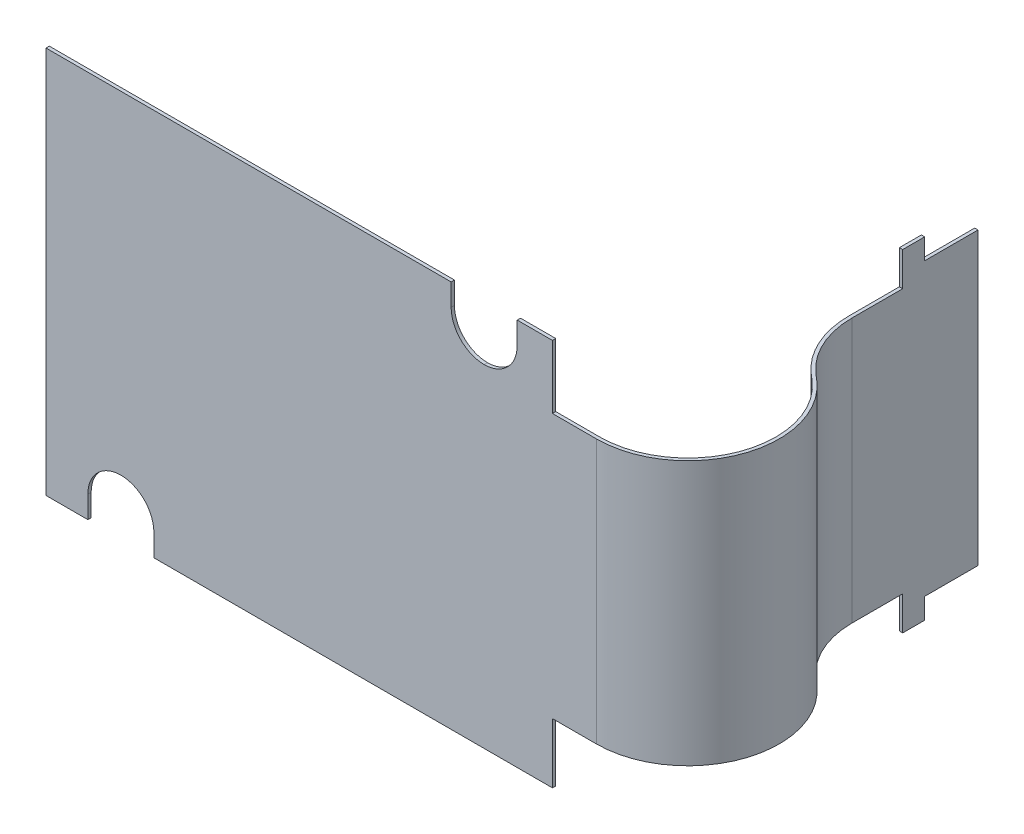
ISO-10303-21;
HEADER;
FILE_DESCRIPTION(('STEP AP214'),'2;1');
FILE_NAME('part.step','',(''),(''),'','','');
FILE_SCHEMA(('AUTOMOTIVE_DESIGN { 1 0 10303 214 1 1 1 1 }'));
ENDSEC;
DATA;
#1=APPLICATION_CONTEXT('core data for automotive mechanical design processes');
#2=APPLICATION_PROTOCOL_DEFINITION('international standard','automotive_design',2000,#1);
#3=PRODUCT_CONTEXT('',#1,'mechanical');
#4=PRODUCT('Part','Part','',(#3));
#5=PRODUCT_RELATED_PRODUCT_CATEGORY('part','',(#4));
#6=PRODUCT_DEFINITION_FORMATION('','',#4);
#7=PRODUCT_DEFINITION_CONTEXT('part definition',#1,'design');
#8=PRODUCT_DEFINITION('design','',#6,#7);
#9=PRODUCT_DEFINITION_SHAPE('','',#8);
#10=(LENGTH_UNIT() NAMED_UNIT(*) SI_UNIT(.MILLI.,.METRE.));
#11=(NAMED_UNIT(*) PLANE_ANGLE_UNIT() SI_UNIT($,.RADIAN.));
#12=(NAMED_UNIT(*) SI_UNIT($,.STERADIAN.) SOLID_ANGLE_UNIT());
#13=UNCERTAINTY_MEASURE_WITH_UNIT(LENGTH_MEASURE(1.E-05),#10,'distance_accuracy_value','');
#14=(GEOMETRIC_REPRESENTATION_CONTEXT(3) GLOBAL_UNCERTAINTY_ASSIGNED_CONTEXT((#13)) GLOBAL_UNIT_ASSIGNED_CONTEXT((#10,
#11,#12)) REPRESENTATION_CONTEXT('',''));
#15=CARTESIAN_POINT('',(0.,0.,0.));
#16=DIRECTION('',(0.,0.,1.));
#17=DIRECTION('',(1.,0.,0.));
#18=AXIS2_PLACEMENT_3D('',#15,#16,#17);
#19=CARTESIAN_POINT('',(8.747498627092,0.,6.679117975626));
#20=DIRECTION('',(-1.,0.,0.));
#21=DIRECTION('',(0.,0.,1.));
#22=AXIS2_PLACEMENT_3D('',#19,#20,#21);
#23=PLANE('',#22);
#24=DIRECTION('',(0.,1.,0.));
#25=VECTOR('',#24,1.);
#26=CARTESIAN_POINT('',(8.747498627092,-3.685,-9.610882024374));
#27=LINE('',#26,#25);
#28=CARTESIAN_POINT('',(8.747498627092,-4.07,-9.610882024374));
#29=VERTEX_POINT('',#28);
#30=CARTESIAN_POINT('',(8.747498627092,-3.3,-9.610882024374));
#31=VERTEX_POINT('',#30);
#32=EDGE_CURVE('E352',#29,#31,#27,.T.);
#33=ORIENTED_EDGE('',*,*,#32,.T.);
#34=DIRECTION('',(0.,0.,1.));
#35=VECTOR('',#34,1.);
#36=CARTESIAN_POINT('',(8.747498627092,-3.3,-8.170848017979));
#37=LINE('',#36,#35);
#38=CARTESIAN_POINT('',(8.747498627091,-3.3,-8.461653345206));
#39=VERTEX_POINT('',#38);
#40=EDGE_CURVE('E332',#31,#39,#37,.T.);
#41=ORIENTED_EDGE('',*,*,#40,.T.);
#42=DIRECTION('',(0.,-1.,0.));
#43=VECTOR('',#42,1.);
#44=CARTESIAN_POINT('',(8.74749862709,2.7,-8.461653345206));
#45=LINE('',#44,#43);
#46=CARTESIAN_POINT('',(8.7474986270905,2.7,-8.461653345206));
#47=VERTEX_POINT('',#46);
#48=EDGE_CURVE('E324',#47,#39,#45,.T.);
#49=ORIENTED_EDGE('',*,*,#48,.F.);
#50=DIRECTION('',(0.,0.,-1.));
#51=VECTOR('',#50,1.);
#52=CARTESIAN_POINT('',(8.747498627091,2.7,-8.170848017979));
#53=LINE('',#52,#51);
#54=CARTESIAN_POINT('',(8.747498627091,2.7,-9.610882024374));
#55=VERTEX_POINT('',#54);
#56=EDGE_CURVE('E329',#47,#55,#53,.T.);
#57=ORIENTED_EDGE('',*,*,#56,.T.);
#58=DIRECTION('',(0.,1.,0.));
#59=VECTOR('',#58,1.);
#60=CARTESIAN_POINT('',(8.747498627092,3.085,-9.610882024374));
#61=LINE('',#60,#59);
#62=CARTESIAN_POINT('',(8.747498627092,3.47,-9.610882024374));
#63=VERTEX_POINT('',#62);
#64=EDGE_CURVE('E323',#55,#63,#61,.T.);
#65=ORIENTED_EDGE('',*,*,#64,.T.);
#66=DIRECTION('',(0.,0.,-1.));
#67=VECTOR('',#66,1.);
#68=CARTESIAN_POINT('',(8.747498627092,3.47,-9.860882024374));
#69=LINE('',#68,#67);
#70=CARTESIAN_POINT('',(8.747498627092,3.47,-10.11088202437));
#71=VERTEX_POINT('',#70);
#72=EDGE_CURVE('E318',#63,#71,#69,.T.);
#73=ORIENTED_EDGE('',*,*,#72,.T.);
#74=DIRECTION('',(0.,1.,0.));
#75=VECTOR('',#74,1.);
#76=CARTESIAN_POINT('',(8.747498627092,3.235,-10.11088202437));
#77=LINE('',#76,#75);
#78=CARTESIAN_POINT('',(8.747498627092,3.,-10.11088202437));
#79=VERTEX_POINT('',#78);
#80=EDGE_CURVE('E313',#71,#79,#77,.F.);
#81=ORIENTED_EDGE('',*,*,#80,.T.);
#82=DIRECTION('',(0.,0.,-1.));
#83=VECTOR('',#82,1.);
#84=CARTESIAN_POINT('',(8.747498627092,3.,-10.71588202437));
#85=LINE('',#84,#83);
#86=CARTESIAN_POINT('',(8.747498627092,3.,-11.32088202437));
#87=VERTEX_POINT('',#86);
#88=EDGE_CURVE('E312',#79,#87,#85,.T.);
#89=ORIENTED_EDGE('',*,*,#88,.T.);
#90=DIRECTION('',(0.,1.,0.));
#91=VECTOR('',#90,1.);
#92=CARTESIAN_POINT('',(8.747498627092,2.85,-11.32088202437));
#93=LINE('',#92,#91);
#94=CARTESIAN_POINT('',(8.747498627092,-3.6,-11.32088202437));
#95=VERTEX_POINT('',#94);
#96=EDGE_CURVE('E411',#95,#87,#93,.T.);
#97=ORIENTED_EDGE('',*,*,#96,.F.);
#98=DIRECTION('',(0.,0.,1.));
#99=VECTOR('',#98,1.);
#100=CARTESIAN_POINT('',(8.747498627092,-3.6,-10.71588202437));
#101=LINE('',#100,#99);
#102=CARTESIAN_POINT('',(8.747498627092,-3.6,-10.11088202437));
#103=VERTEX_POINT('',#102);
#104=EDGE_CURVE('E398',#95,#103,#101,.T.);
#105=ORIENTED_EDGE('',*,*,#104,.T.);
#106=DIRECTION('',(0.,1.,0.));
#107=VECTOR('',#106,1.);
#108=CARTESIAN_POINT('',(8.747498627092,-3.835,-10.11088202437));
#109=LINE('',#108,#107);
#110=CARTESIAN_POINT('',(8.747498627092,-4.07,-10.11088202437));
#111=VERTEX_POINT('',#110);
#112=EDGE_CURVE('E384',#103,#111,#109,.F.);
#113=ORIENTED_EDGE('',*,*,#112,.T.);
#114=DIRECTION('',(0.,0.,1.));
#115=VECTOR('',#114,1.);
#116=CARTESIAN_POINT('',(8.747498627092,-4.07,-9.860882024374));
#117=LINE('',#116,#115);
#118=EDGE_CURVE('E370',#111,#29,#117,.T.);
#119=ORIENTED_EDGE('',*,*,#118,.T.);
#120=EDGE_LOOP('',(#33,#41,#49,#57,#65,#73,#81,#89,#97,#105,#113,#119));
#121=FACE_BOUND('',#120,.T.);
#122=ADVANCED_FACE('F17',(#121),#23,.T.);
#123=CARTESIAN_POINT('',(8.784998627092,2.85,-11.32088202437));
#124=DIRECTION('',(0.,0.,-1.));
#125=DIRECTION('',(-1.,0.,0.));
#126=AXIS2_PLACEMENT_3D('',#123,#124,#125);
#127=PLANE('',#126);
#128=DIRECTION('',(1.,0.,0.));
#129=VECTOR('',#128,1.);
#130=CARTESIAN_POINT('',(8.784998627092,-3.6,-11.32088202437));
#131=LINE('',#130,#129);
#132=CARTESIAN_POINT('',(8.822498627092,-3.6,-11.32088202437));
#133=VERTEX_POINT('',#132);
#134=EDGE_CURVE('E402',#133,#95,#131,.F.);
#135=ORIENTED_EDGE('',*,*,#134,.T.);
#136=ORIENTED_EDGE('',*,*,#96,.T.);
#137=DIRECTION('',(1.,0.,0.));
#138=VECTOR('',#137,1.);
#139=CARTESIAN_POINT('',(8.784998627092,3.,-11.32088202437));
#140=LINE('',#139,#138);
#141=CARTESIAN_POINT('',(8.822498627092,3.,-11.32088202437));
#142=VERTEX_POINT('',#141);
#143=EDGE_CURVE('E421',#87,#142,#140,.T.);
#144=ORIENTED_EDGE('',*,*,#143,.T.);
#145=DIRECTION('',(0.,1.,0.));
#146=VECTOR('',#145,1.);
#147=CARTESIAN_POINT('',(8.822498627092,0.,-11.32088202437));
#148=LINE('',#147,#146);
#149=EDGE_CURVE('E327',#142,#133,#148,.F.);
#150=ORIENTED_EDGE('',*,*,#149,.T.);
#151=EDGE_LOOP('',(#135,#136,#144,#150));
#152=FACE_BOUND('',#151,.T.);
#153=ADVANCED_FACE('F532',(#152),#127,.T.);
#154=CARTESIAN_POINT('',(8.784998627092,-3.6,-10.71588202437));
#155=DIRECTION('',(0.,1.,0.));
#156=DIRECTION('',(0.,0.,1.));
#157=AXIS2_PLACEMENT_3D('',#154,#155,#156);
#158=PLANE('',#157);
#159=ORIENTED_EDGE('',*,*,#104,.F.);
#160=ORIENTED_EDGE('',*,*,#134,.F.);
#161=DIRECTION('',(0.,0.,1.));
#162=VECTOR('',#161,1.);
#163=CARTESIAN_POINT('',(8.822498627092,-3.6,6.679117975626));
#164=LINE('',#163,#162);
#165=CARTESIAN_POINT('',(8.822498627092,-3.6,-10.11088202437));
#166=VERTEX_POINT('',#165);
#167=EDGE_CURVE('E393',#133,#166,#164,.T.);
#168=ORIENTED_EDGE('',*,*,#167,.T.);
#169=DIRECTION('',(1.,0.,0.));
#170=VECTOR('',#169,1.);
#171=CARTESIAN_POINT('',(8.784998627092,-3.6,-10.11088202437));
#172=LINE('',#171,#170);
#173=EDGE_CURVE('E388',#166,#103,#172,.F.);
#174=ORIENTED_EDGE('',*,*,#173,.T.);
#175=EDGE_LOOP('',(#159,#160,#168,#174));
#176=FACE_BOUND('',#175,.T.);
#177=ADVANCED_FACE('F530',(#176),#158,.F.);
#178=CARTESIAN_POINT('',(8.784998627092,-3.835,-10.11088202437));
#179=DIRECTION('',(0.,0.,1.));
#180=DIRECTION('',(1.,0.,0.));
#181=AXIS2_PLACEMENT_3D('',#178,#179,#180);
#182=PLANE('',#181);
#183=ORIENTED_EDGE('',*,*,#112,.F.);
#184=ORIENTED_EDGE('',*,*,#173,.F.);
#185=DIRECTION('',(0.,1.,0.));
#186=VECTOR('',#185,1.);
#187=CARTESIAN_POINT('',(8.822498627092,0.,-10.11088202437));
#188=LINE('',#187,#186);
#189=CARTESIAN_POINT('',(8.822498627092,-4.07,-10.11088202437));
#190=VERTEX_POINT('',#189);
#191=EDGE_CURVE('E379',#166,#190,#188,.F.);
#192=ORIENTED_EDGE('',*,*,#191,.T.);
#193=DIRECTION('',(1.,0.,0.));
#194=VECTOR('',#193,1.);
#195=CARTESIAN_POINT('',(8.784998627092,-4.07,-10.11088202437));
#196=LINE('',#195,#194);
#197=EDGE_CURVE('E374',#190,#111,#196,.F.);
#198=ORIENTED_EDGE('',*,*,#197,.T.);
#199=EDGE_LOOP('',(#183,#184,#192,#198));
#200=FACE_BOUND('',#199,.T.);
#201=ADVANCED_FACE('F526',(#200),#182,.F.);
#202=CARTESIAN_POINT('',(8.784998627092,-4.07,-9.860882024374));
#203=DIRECTION('',(0.,1.,0.));
#204=DIRECTION('',(0.,0.,1.));
#205=AXIS2_PLACEMENT_3D('',#202,#203,#204);
#206=PLANE('',#205);
#207=ORIENTED_EDGE('',*,*,#118,.F.);
#208=ORIENTED_EDGE('',*,*,#197,.F.);
#209=DIRECTION('',(0.,0.,1.));
#210=VECTOR('',#209,1.);
#211=CARTESIAN_POINT('',(8.822498627092,-4.07,6.679117975626));
#212=LINE('',#211,#210);
#213=CARTESIAN_POINT('',(8.822498627092,-4.07,-9.610882024374));
#214=VERTEX_POINT('',#213);
#215=EDGE_CURVE('E365',#190,#214,#212,.T.);
#216=ORIENTED_EDGE('',*,*,#215,.T.);
#217=DIRECTION('',(-1.,0.,0.));
#218=VECTOR('',#217,1.);
#219=CARTESIAN_POINT('',(8.784998627092,-4.07,-9.610882024374));
#220=LINE('',#219,#218);
#221=EDGE_CURVE('E356',#214,#29,#220,.T.);
#222=ORIENTED_EDGE('',*,*,#221,.T.);
#223=EDGE_LOOP('',(#207,#208,#216,#222));
#224=FACE_BOUND('',#223,.T.);
#225=ADVANCED_FACE('F523',(#224),#206,.F.);
#226=CARTESIAN_POINT('',(8.784998627092,-3.685,-9.610882024374));
#227=DIRECTION('',(0.,0.,-1.));
#228=DIRECTION('',(-1.,0.,0.));
#229=AXIS2_PLACEMENT_3D('',#226,#227,#228);
#230=PLANE('',#229);
#231=ORIENTED_EDGE('',*,*,#32,.F.);
#232=ORIENTED_EDGE('',*,*,#221,.F.);
#233=DIRECTION('',(0.,1.,0.));
#234=VECTOR('',#233,1.);
#235=CARTESIAN_POINT('',(8.822498627092,0.,-9.610882024374));
#236=LINE('',#235,#234);
#237=CARTESIAN_POINT('',(8.82249862709175,-3.3,-9.610882024374));
#238=VERTEX_POINT('',#237);
#239=EDGE_CURVE('E360',#214,#238,#236,.T.);
#240=ORIENTED_EDGE('',*,*,#239,.T.);
#241=DIRECTION('',(1.,0.,0.));
#242=VECTOR('',#241,1.);
#243=CARTESIAN_POINT('',(8.784998627092,-3.3,-9.610882024374));
#244=LINE('',#243,#242);
#245=EDGE_CURVE('E347',#238,#31,#244,.F.);
#246=ORIENTED_EDGE('',*,*,#245,.T.);
#247=EDGE_LOOP('',(#231,#232,#240,#246));
#248=FACE_BOUND('',#247,.T.);
#249=ADVANCED_FACE('F514',(#248),#230,.F.);
#250=CARTESIAN_POINT('',(8.784998627092,3.085,-9.610882024374));
#251=DIRECTION('',(0.,0.,-1.));
#252=DIRECTION('',(-1.,0.,0.));
#253=AXIS2_PLACEMENT_3D('',#250,#251,#252);
#254=PLANE('',#253);
#255=ORIENTED_EDGE('',*,*,#64,.F.);
#256=DIRECTION('',(-1.,0.,0.));
#257=VECTOR('',#256,1.);
#258=CARTESIAN_POINT('',(8.784998627092,2.7,-9.610882024374));
#259=LINE('',#258,#257);
#260=CARTESIAN_POINT('',(8.822498627092,2.7,-9.610882024374));
#261=VERTEX_POINT('',#260);
#262=EDGE_CURVE('E331',#261,#55,#259,.T.);
#263=ORIENTED_EDGE('',*,*,#262,.F.);
#264=DIRECTION('',(0.,1.,0.));
#265=VECTOR('',#264,1.);
#266=CARTESIAN_POINT('',(8.822498627092,0.,-9.610882024374));
#267=LINE('',#266,#265);
#268=CARTESIAN_POINT('',(8.822498627092,3.47,-9.610882024374));
#269=VERTEX_POINT('',#268);
#270=EDGE_CURVE('E305',#261,#269,#267,.T.);
#271=ORIENTED_EDGE('',*,*,#270,.T.);
#272=DIRECTION('',(1.,0.,0.));
#273=VECTOR('',#272,1.);
#274=CARTESIAN_POINT('',(8.784998627092,3.47,-9.610882024374));
#275=LINE('',#274,#273);
#276=EDGE_CURVE('E320',#269,#63,#275,.F.);
#277=ORIENTED_EDGE('',*,*,#276,.T.);
#278=EDGE_LOOP('',(#255,#263,#271,#277));
#279=FACE_BOUND('',#278,.T.);
#280=ADVANCED_FACE('F546',(#279),#254,.F.);
#281=CARTESIAN_POINT('',(8.784998627092,3.47,-9.860882024374));
#282=DIRECTION('',(0.,-1.,0.));
#283=DIRECTION('',(0.,0.,-1.));
#284=AXIS2_PLACEMENT_3D('',#281,#282,#283);
#285=PLANE('',#284);
#286=ORIENTED_EDGE('',*,*,#72,.F.);
#287=ORIENTED_EDGE('',*,*,#276,.F.);
#288=DIRECTION('',(0.,0.,1.));
#289=VECTOR('',#288,1.);
#290=CARTESIAN_POINT('',(8.822498627092,3.47,6.679117975626));
#291=LINE('',#290,#289);
#292=CARTESIAN_POINT('',(8.822498627092,3.47,-10.11088202437));
#293=VERTEX_POINT('',#292);
#294=EDGE_CURVE('E302',#269,#293,#291,.F.);
#295=ORIENTED_EDGE('',*,*,#294,.T.);
#296=DIRECTION('',(1.,0.,0.));
#297=VECTOR('',#296,1.);
#298=CARTESIAN_POINT('',(8.784998627092,3.47,-10.11088202437));
#299=LINE('',#298,#297);
#300=EDGE_CURVE('E315',#293,#71,#299,.F.);
#301=ORIENTED_EDGE('',*,*,#300,.T.);
#302=EDGE_LOOP('',(#286,#287,#295,#301));
#303=FACE_BOUND('',#302,.T.);
#304=ADVANCED_FACE('F542',(#303),#285,.F.);
#305=CARTESIAN_POINT('',(8.784998627092,3.235,-10.11088202437));
#306=DIRECTION('',(0.,0.,1.));
#307=DIRECTION('',(1.,0.,0.));
#308=AXIS2_PLACEMENT_3D('',#305,#306,#307);
#309=PLANE('',#308);
#310=ORIENTED_EDGE('',*,*,#80,.F.);
#311=ORIENTED_EDGE('',*,*,#300,.F.);
#312=DIRECTION('',(0.,1.,0.));
#313=VECTOR('',#312,1.);
#314=CARTESIAN_POINT('',(8.822498627092,0.,-10.11088202437));
#315=LINE('',#314,#313);
#316=CARTESIAN_POINT('',(8.822498627092,3.,-10.11088202437));
#317=VERTEX_POINT('',#316);
#318=EDGE_CURVE('E299',#293,#317,#315,.F.);
#319=ORIENTED_EDGE('',*,*,#318,.T.);
#320=DIRECTION('',(1.,0.,0.));
#321=VECTOR('',#320,1.);
#322=CARTESIAN_POINT('',(8.784998627092,3.,-10.11088202437));
#323=LINE('',#322,#321);
#324=EDGE_CURVE('E309',#317,#79,#323,.F.);
#325=ORIENTED_EDGE('',*,*,#324,.T.);
#326=EDGE_LOOP('',(#310,#311,#319,#325));
#327=FACE_BOUND('',#326,.T.);
#328=ADVANCED_FACE('F539',(#327),#309,.F.);
#329=CARTESIAN_POINT('',(8.784998627092,3.,-10.71588202437));
#330=DIRECTION('',(0.,-1.,0.));
#331=DIRECTION('',(0.,0.,-1.));
#332=AXIS2_PLACEMENT_3D('',#329,#330,#331);
#333=PLANE('',#332);
#334=ORIENTED_EDGE('',*,*,#88,.F.);
#335=ORIENTED_EDGE('',*,*,#324,.F.);
#336=DIRECTION('',(0.,0.,1.));
#337=VECTOR('',#336,1.);
#338=CARTESIAN_POINT('',(8.822498627092,3.,6.679117975626));
#339=LINE('',#338,#337);
#340=EDGE_CURVE('E296',#317,#142,#339,.F.);
#341=ORIENTED_EDGE('',*,*,#340,.T.);
#342=ORIENTED_EDGE('',*,*,#143,.F.);
#343=EDGE_LOOP('',(#334,#335,#341,#342));
#344=FACE_BOUND('',#343,.T.);
#345=ADVANCED_FACE('F548',(#344),#333,.F.);
#346=CARTESIAN_POINT('',(10.82249862709,2.7,-8.461653345206));
#347=DIRECTION('',(0.,-1.,0.));
#348=DIRECTION('',(0.,0.,-1.));
#349=AXIS2_PLACEMENT_3D('',#346,#347,#348);
#350=CYLINDRICAL_SURFACE('',#349,2.075);
#351=CARTESIAN_POINT('',(10.82249862709,2.7,-8.461653345206));
#352=DIRECTION('',(0.,-1.,0.));
#353=DIRECTION('',(0.,0.,-1.));
#354=AXIS2_PLACEMENT_3D('',#351,#352,#353);
#355=CIRCLE('',#354,2.075);
#356=CARTESIAN_POINT('',(9.46117614194191,2.7,-6.89563096623744));
#357=VERTEX_POINT('',#356);
#358=EDGE_CURVE('E328',#357,#47,#355,.T.);
#359=ORIENTED_EDGE('',*,*,#358,.T.);
#360=ORIENTED_EDGE('',*,*,#48,.T.);
#361=CARTESIAN_POINT('',(10.82249862709,-3.3,-8.461653345206));
#362=DIRECTION('',(0.,-1.,0.));
#363=DIRECTION('',(0.,0.,-1.));
#364=AXIS2_PLACEMENT_3D('',#361,#362,#363);
#365=CIRCLE('',#364,2.075);
#366=CARTESIAN_POINT('',(9.46117614194191,-3.3,-6.89563096623744));
#367=VERTEX_POINT('',#366);
#368=EDGE_CURVE('E424',#39,#367,#365,.F.);
#369=ORIENTED_EDGE('',*,*,#368,.T.);
#370=DIRECTION('',(0.,1.,0.));
#371=VECTOR('',#370,1.);
#372=CARTESIAN_POINT('',(9.46117614193544,0.,-6.89563096624351));
#373=LINE('',#372,#371);
#374=EDGE_CURVE('E293',#357,#367,#373,.F.);
#375=ORIENTED_EDGE('',*,*,#374,.F.);
#376=EDGE_LOOP('',(#359,#360,#369,#375));
#377=FACE_BOUND('',#376,.T.);
#378=ADVANCED_FACE('F498',(#377),#350,.T.);
#379=CARTESIAN_POINT('',(8.822498627092,0.,6.679117975626));
#380=DIRECTION('',(-1.,0.,0.));
#381=DIRECTION('',(0.,0.,1.));
#382=AXIS2_PLACEMENT_3D('',#379,#380,#381);
#383=PLANE('',#382);
#384=ORIENTED_EDGE('',*,*,#318,.F.);
#385=ORIENTED_EDGE('',*,*,#294,.F.);
#386=ORIENTED_EDGE('',*,*,#270,.F.);
#387=DIRECTION('',(0.,0.,1.));
#388=VECTOR('',#387,1.);
#389=CARTESIAN_POINT('',(8.822498627092,2.7,6.679117975626));
#390=LINE('',#389,#388);
#391=CARTESIAN_POINT('',(8.822498627091,2.7,-8.461653345206));
#392=VERTEX_POINT('',#391);
#393=EDGE_CURVE('E308',#392,#261,#390,.F.);
#394=ORIENTED_EDGE('',*,*,#393,.F.);
#395=DIRECTION('',(0.,-1.,0.));
#396=VECTOR('',#395,1.);
#397=CARTESIAN_POINT('',(8.82249862709,2.7,-8.461653345206));
#398=LINE('',#397,#396);
#399=CARTESIAN_POINT('',(8.822498627091,-3.3,-8.461653345206));
#400=VERTEX_POINT('',#399);
#401=EDGE_CURVE('E290',#392,#400,#398,.T.);
#402=ORIENTED_EDGE('',*,*,#401,.T.);
#403=DIRECTION('',(0.,0.,1.));
#404=VECTOR('',#403,1.);
#405=CARTESIAN_POINT('',(8.822498627092,-3.3,6.679117975626));
#406=LINE('',#405,#404);
#407=EDGE_CURVE('E237',#238,#400,#406,.T.);
#408=ORIENTED_EDGE('',*,*,#407,.F.);
#409=ORIENTED_EDGE('',*,*,#239,.F.);
#410=ORIENTED_EDGE('',*,*,#215,.F.);
#411=ORIENTED_EDGE('',*,*,#191,.F.);
#412=ORIENTED_EDGE('',*,*,#167,.F.);
#413=ORIENTED_EDGE('',*,*,#149,.F.);
#414=ORIENTED_EDGE('',*,*,#340,.F.);
#415=EDGE_LOOP('',(#384,#385,#386,#394,#402,#408,#409,#410,#411,#412,#413,#414));
#416=FACE_BOUND('',#415,.T.);
#417=ADVANCED_FACE('F519',(#416),#383,.F.);
#418=CARTESIAN_POINT('',(19.58178028282,0.,1.902075992115));
#419=DIRECTION('',(-0.656059028990489,0.,0.754709580222788));
#420=DIRECTION('',(0.754709580222788,0.,0.656059028990489));
#421=AXIS2_PLACEMENT_3D('',#418,#419,#420);
#422=PLANE('',#421);
#423=DIRECTION('',(-0.754709580228608,0.,-0.656059028983794));
#424=VECTOR('',#423,1.);
#425=CARTESIAN_POINT('',(9.612118057981,2.7,-6.764419160446));
#426=LINE('',#425,#424);
#427=CARTESIAN_POINT('',(9.61211805797429,2.7,-6.76441916045161));
#428=VERTEX_POINT('',#427);
#429=EDGE_CURVE('E286',#428,#357,#426,.T.);
#430=ORIENTED_EDGE('',*,*,#429,.T.);
#431=ORIENTED_EDGE('',*,*,#374,.T.);
#432=DIRECTION('',(0.754709580228608,0.,0.656059028983794));
#433=VECTOR('',#432,1.);
#434=CARTESIAN_POINT('',(9.461176141935,-3.3,-6.895630966243));
#435=LINE('',#434,#433);
#436=CARTESIAN_POINT('',(9.61211805797429,-3.3,-6.76441916045161));
#437=VERTEX_POINT('',#436);
#438=EDGE_CURVE('E287',#367,#437,#435,.T.);
#439=ORIENTED_EDGE('',*,*,#438,.T.);
#440=DIRECTION('',(0.,-1.,0.));
#441=VECTOR('',#440,1.);
#442=CARTESIAN_POINT('',(9.61211805798078,2.7,-6.76441916044575));
#443=LINE('',#442,#441);
#444=EDGE_CURVE('E282',#437,#428,#443,.F.);
#445=ORIENTED_EDGE('',*,*,#444,.T.);
#446=EDGE_LOOP('',(#430,#431,#439,#445));
#447=FACE_BOUND('',#446,.T.);
#448=ADVANCED_FACE('F503',(#447),#422,.T.);
#449=CARTESIAN_POINT('',(10.82249862709,2.7,-8.461653345206));
#450=DIRECTION('',(0.,-1.,0.));
#451=DIRECTION('',(0.,0.,-1.));
#452=AXIS2_PLACEMENT_3D('',#449,#450,#451);
#453=CYLINDRICAL_SURFACE('',#452,2.);
#454=DIRECTION('',(0.,1.,0.));
#455=VECTOR('',#454,1.);
#456=CARTESIAN_POINT('',(9.51038056910772,0.,-6.95223418475853));
#457=LINE('',#456,#455);
#458=CARTESIAN_POINT('',(9.51038056910837,2.7,-6.95223418475948));
#459=VERTEX_POINT('',#458);
#460=CARTESIAN_POINT('',(9.51038056910837,-3.3,-6.95223418475948));
#461=VERTEX_POINT('',#460);
#462=EDGE_CURVE('E244',#459,#461,#457,.F.);
#463=ORIENTED_EDGE('',*,*,#462,.T.);
#464=CARTESIAN_POINT('',(10.82249862709,-3.3,-8.461653345206));
#465=DIRECTION('',(0.,-1.,0.));
#466=DIRECTION('',(0.,0.,-1.));
#467=AXIS2_PLACEMENT_3D('',#464,#465,#466);
#468=CIRCLE('',#467,2.);
#469=EDGE_CURVE('E20',#461,#400,#468,.T.);
#470=ORIENTED_EDGE('',*,*,#469,.T.);
#471=ORIENTED_EDGE('',*,*,#401,.F.);
#472=CARTESIAN_POINT('',(10.82249862709,2.7,-8.461653345206));
#473=DIRECTION('',(0.,-1.,0.));
#474=DIRECTION('',(0.,0.,-1.));
#475=AXIS2_PLACEMENT_3D('',#472,#473,#474);
#476=CIRCLE('',#475,2.);
#477=EDGE_CURVE('E241',#392,#459,#476,.F.);
#478=ORIENTED_EDGE('',*,*,#477,.T.);
#479=EDGE_LOOP('',(#463,#470,#471,#478));
#480=FACE_BOUND('',#479,.T.);
#481=ADVANCED_FACE('F245',(#480),#453,.F.);
#482=CARTESIAN_POINT('',(8.3,2.7,-5.255));
#483=DIRECTION('',(0.,-1.,0.));
#484=DIRECTION('',(0.,0.,-1.));
#485=AXIS2_PLACEMENT_3D('',#482,#483,#484);
#486=CYLINDRICAL_SURFACE('',#485,2.);
#487=DIRECTION('',(0.,1.,0.));
#488=VECTOR('',#487,1.);
#489=CARTESIAN_POINT('',(8.3,0.,-3.255));
#490=LINE('',#489,#488);
#491=CARTESIAN_POINT('',(8.3,2.7,-3.255));
#492=VERTEX_POINT('',#491);
#493=CARTESIAN_POINT('',(8.3,-3.3,-3.255));
#494=VERTEX_POINT('',#493);
#495=EDGE_CURVE('E258',#492,#494,#490,.F.);
#496=ORIENTED_EDGE('',*,*,#495,.F.);
#497=CARTESIAN_POINT('',(8.3,2.7,-5.255));
#498=DIRECTION('',(0.,-1.,0.));
#499=DIRECTION('',(0.,0.,-1.));
#500=AXIS2_PLACEMENT_3D('',#497,#498,#499);
#501=CIRCLE('',#500,2.);
#502=EDGE_CURVE('E285',#492,#428,#501,.F.);
#503=ORIENTED_EDGE('',*,*,#502,.T.);
#504=ORIENTED_EDGE('',*,*,#444,.F.);
#505=CARTESIAN_POINT('',(8.3,-3.3,-5.255));
#506=DIRECTION('',(0.,-1.,0.));
#507=DIRECTION('',(0.,0.,-1.));
#508=AXIS2_PLACEMENT_3D('',#505,#506,#507);
#509=CIRCLE('',#508,2.);
#510=EDGE_CURVE('E247',#437,#494,#509,.T.);
#511=ORIENTED_EDGE('',*,*,#510,.T.);
#512=EDGE_LOOP('',(#496,#503,#504,#511));
#513=FACE_BOUND('',#512,.T.);
#514=ADVANCED_FACE('F508',(#513),#486,.F.);
#515=CARTESIAN_POINT('',(19.63098470999,0.,1.845472773598));
#516=DIRECTION('',(-0.656059028990489,0.,0.754709580222788));
#517=DIRECTION('',(0.754709580222788,0.,0.656059028990489));
#518=AXIS2_PLACEMENT_3D('',#515,#516,#517);
#519=PLANE('',#518);
#520=DIRECTION('',(0.,-1.,0.));
#521=VECTOR('',#520,1.);
#522=CARTESIAN_POINT('',(9.66132248515526,2.7,-6.82102237896229));
#523=LINE('',#522,#521);
#524=CARTESIAN_POINT('',(9.66132248515415,-3.3,-6.82102237896102));
#525=VERTEX_POINT('',#524);
#526=CARTESIAN_POINT('',(9.66132248515415,2.7,-6.82102237896103));
#527=VERTEX_POINT('',#526);
#528=EDGE_CURVE('E251',#525,#527,#523,.F.);
#529=ORIENTED_EDGE('',*,*,#528,.F.);
#530=DIRECTION('',(0.754709580222788,0.,0.656059028990489));
#531=VECTOR('',#530,1.);
#532=CARTESIAN_POINT('',(19.63098470999,-3.3,1.845472773598));
#533=LINE('',#532,#531);
#534=EDGE_CURVE('E234',#461,#525,#533,.T.);
#535=ORIENTED_EDGE('',*,*,#534,.F.);
#536=ORIENTED_EDGE('',*,*,#462,.F.);
#537=DIRECTION('',(0.754709580222788,0.,0.656059028990489));
#538=VECTOR('',#537,1.);
#539=CARTESIAN_POINT('',(19.63098470999,2.7,1.845472773598));
#540=LINE('',#539,#538);
#541=EDGE_CURVE('E252',#527,#459,#540,.F.);
#542=ORIENTED_EDGE('',*,*,#541,.F.);
#543=EDGE_LOOP('',(#529,#535,#536,#542));
#544=FACE_BOUND('',#543,.T.);
#545=ADVANCED_FACE('F249',(#544),#519,.F.);
#546=CARTESIAN_POINT('',(0.,0.,-3.255));
#547=DIRECTION('',(0.,0.,-1.));
#548=DIRECTION('',(-1.,0.,0.));
#549=AXIS2_PLACEMENT_3D('',#546,#547,#548);
#550=PLANE('',#549);
#551=DIRECTION('',(-1.,0.,0.));
#552=VECTOR('',#551,1.);
#553=CARTESIAN_POINT('',(0.,2.7,-3.255));
#554=LINE('',#553,#552);
#555=CARTESIAN_POINT('',(7.3,2.7,-3.255));
#556=VERTEX_POINT('',#555);
#557=EDGE_CURVE('E263',#556,#492,#554,.F.);
#558=ORIENTED_EDGE('',*,*,#557,.T.);
#559=ORIENTED_EDGE('',*,*,#495,.T.);
#560=DIRECTION('',(1.,0.,0.));
#561=VECTOR('',#560,1.);
#562=CARTESIAN_POINT('',(11.795,-3.3,-3.255));
#563=LINE('',#562,#561);
#564=CARTESIAN_POINT('',(7.3,-3.3,-3.255));
#565=VERTEX_POINT('',#564);
#566=EDGE_CURVE('E260',#494,#565,#563,.F.);
#567=ORIENTED_EDGE('',*,*,#566,.T.);
#568=DIRECTION('',(0.,1.,0.));
#569=VECTOR('',#568,1.);
#570=CARTESIAN_POINT('',(7.3,-3.981447424999,-3.255));
#571=LINE('',#570,#569);
#572=CARTESIAN_POINT('',(7.3,-4.662894849998,-3.255));
#573=VERTEX_POINT('',#572);
#574=EDGE_CURVE('E935',#565,#573,#571,.F.);
#575=ORIENTED_EDGE('',*,*,#574,.T.);
#576=DIRECTION('',(1.,0.,0.));
#577=VECTOR('',#576,1.);
#578=CARTESIAN_POINT('',(2.775,-4.662894849998,-3.255));
#579=LINE('',#578,#577);
#580=CARTESIAN_POINT('',(-1.75000017484467,-4.662894849998,-3.255));
#581=VERTEX_POINT('',#580);
#582=EDGE_CURVE('E923',#573,#581,#579,.F.);
#583=ORIENTED_EDGE('',*,*,#582,.T.);
#584=DIRECTION('',(0.,1.,0.));
#585=VECTOR('',#584,1.);
#586=CARTESIAN_POINT('',(-1.75,-4.41294876446,-3.255));
#587=LINE('',#586,#585);
#588=CARTESIAN_POINT('',(-1.75000487923649,-4.16302586816539,-3.255));
#589=VERTEX_POINT('',#588);
#590=EDGE_CURVE('E480',#581,#589,#587,.T.);
#591=ORIENTED_EDGE('',*,*,#590,.T.);
#592=CARTESIAN_POINT('',(-2.5,-4.162887239936,-3.255));
#593=DIRECTION('',(0.,0.,1.));
#594=DIRECTION('',(1.,0.,0.));
#595=AXIS2_PLACEMENT_3D('',#592,#593,#594);
#596=CIRCLE('',#595,0.7499905672631);
#597=CARTESIAN_POINT('',(-3.24999512076351,-4.16302586816539,-3.255));
#598=VERTEX_POINT('',#597);
#599=EDGE_CURVE('E471',#589,#598,#596,.T.);
#600=ORIENTED_EDGE('',*,*,#599,.T.);
#601=DIRECTION('',(0.,1.,0.));
#602=VECTOR('',#601,1.);
#603=CARTESIAN_POINT('',(-3.25,-4.41294876446,-3.255));
#604=LINE('',#603,#602);
#605=CARTESIAN_POINT('',(-3.24999965031,-4.662894849998,-3.255));
#606=VERTEX_POINT('',#605);
#607=EDGE_CURVE('E470',#598,#606,#604,.F.);
#608=ORIENTED_EDGE('',*,*,#607,.T.);
#609=DIRECTION('',(1.,0.,0.));
#610=VECTOR('',#609,1.);
#611=CARTESIAN_POINT('',(-3.725,-4.662894849998,-3.255));
#612=LINE('',#611,#610);
#613=CARTESIAN_POINT('',(-4.2,-4.662894849998,-3.255));
#614=VERTEX_POINT('',#613);
#615=EDGE_CURVE('E912',#606,#614,#612,.F.);
#616=ORIENTED_EDGE('',*,*,#615,.T.);
#617=DIRECTION('',(0.,1.,0.));
#618=VECTOR('',#617,1.);
#619=CARTESIAN_POINT('',(-4.2,-0.262894849998,-3.255));
#620=LINE('',#619,#618);
#621=CARTESIAN_POINT('',(-4.2,4.137105150002,-3.255));
#622=VERTEX_POINT('',#621);
#623=EDGE_CURVE('E902',#614,#622,#620,.T.);
#624=ORIENTED_EDGE('',*,*,#623,.T.);
#625=DIRECTION('',(1.,0.,0.));
#626=VECTOR('',#625,1.);
#627=CARTESIAN_POINT('',(0.4,4.137105150002,-3.255));
#628=LINE('',#627,#626);
#629=CARTESIAN_POINT('',(5.000000099459,4.137105150002,-3.255));
#630=VERTEX_POINT('',#629);
#631=EDGE_CURVE('E891',#622,#630,#628,.T.);
#632=ORIENTED_EDGE('',*,*,#631,.T.);
#633=DIRECTION('',(0.,1.,0.));
#634=VECTOR('',#633,1.);
#635=CARTESIAN_POINT('',(5.000000298377,0.,-3.255));
#636=LINE('',#635,#634);
#637=CARTESIAN_POINT('',(5.00000268356415,3.637092432144,-3.255));
#638=VERTEX_POINT('',#637);
#639=EDGE_CURVE('E254',#630,#638,#636,.F.);
#640=ORIENTED_EDGE('',*,*,#639,.T.);
#641=CARTESIAN_POINT('',(5.749987282142,3.637092432144,-3.255));
#642=DIRECTION('',(0.,0.,1.));
#643=DIRECTION('',(1.,0.,0.));
#644=AXIS2_PLACEMENT_3D('',#641,#642,#643);
#645=CIRCLE('',#644,0.7499819150137);
#646=CARTESIAN_POINT('',(5.74999999852787,2.88711051723806,-3.255));
#647=VERTEX_POINT('',#646);
#648=EDGE_CURVE('E488',#638,#647,#645,.T.);
#649=ORIENTED_EDGE('',*,*,#648,.T.);
#650=CARTESIAN_POINT('',(5.750012717858,3.637092432144,-3.255));
#651=DIRECTION('',(0.,0.,1.));
#652=DIRECTION('',(1.,0.,0.));
#653=AXIS2_PLACEMENT_3D('',#650,#651,#652);
#654=CIRCLE('',#653,0.7499819150138);
#655=CARTESIAN_POINT('',(6.4999973164359,3.637092432144,-3.255));
#656=VERTEX_POINT('',#655);
#657=EDGE_CURVE('E486',#647,#656,#654,.T.);
#658=ORIENTED_EDGE('',*,*,#657,.T.);
#659=DIRECTION('',(0.,1.,0.));
#660=VECTOR('',#659,1.);
#661=CARTESIAN_POINT('',(6.499997911361,0.,-3.255));
#662=LINE('',#661,#660);
#663=CARTESIAN_POINT('',(6.499998508115,4.137105150002,-3.255));
#664=VERTEX_POINT('',#663);
#665=EDGE_CURVE('E279',#656,#664,#662,.T.);
#666=ORIENTED_EDGE('',*,*,#665,.T.);
#667=DIRECTION('',(-1.,0.,0.));
#668=VECTOR('',#667,1.);
#669=CARTESIAN_POINT('',(0.,4.137105150002,-3.255));
#670=LINE('',#669,#668);
#671=CARTESIAN_POINT('',(7.3,4.137105150002,-3.255));
#672=VERTEX_POINT('',#671);
#673=EDGE_CURVE('E275',#664,#672,#670,.F.);
#674=ORIENTED_EDGE('',*,*,#673,.T.);
#675=DIRECTION('',(0.,1.,0.));
#676=VECTOR('',#675,1.);
#677=CARTESIAN_POINT('',(7.3,0.,-3.255));
#678=LINE('',#677,#676);
#679=EDGE_CURVE('E266',#672,#556,#678,.F.);
#680=ORIENTED_EDGE('',*,*,#679,.T.);
#681=EDGE_LOOP('',(#558,#559,#567,#575,#583,#591,#600,#608,#616,#624,#632,#640,#649,#658,#666,
#674,#680));
#682=FACE_BOUND('',#681,.T.);
#683=ADVANCED_FACE('F629',(#682),#550,.T.);
#684=CARTESIAN_POINT('',(8.3,2.7,-5.255));
#685=DIRECTION('',(0.,-1.,0.));
#686=DIRECTION('',(0.,0.,-1.));
#687=AXIS2_PLACEMENT_3D('',#684,#685,#686);
#688=CYLINDRICAL_SURFACE('',#687,2.075);
#689=CARTESIAN_POINT('',(8.3,-3.3,-5.255));
#690=DIRECTION('',(0.,-1.,0.));
#691=DIRECTION('',(0.,0.,-1.));
#692=AXIS2_PLACEMENT_3D('',#689,#690,#691);
#693=CIRCLE('',#692,2.075);
#694=CARTESIAN_POINT('',(8.3,-3.3,-3.18));
#695=VERTEX_POINT('',#694);
#696=EDGE_CURVE('E261',#695,#525,#693,.F.);
#697=ORIENTED_EDGE('',*,*,#696,.T.);
#698=ORIENTED_EDGE('',*,*,#528,.T.);
#699=CARTESIAN_POINT('',(8.3,2.7,-5.255));
#700=DIRECTION('',(0.,-1.,0.));
#701=DIRECTION('',(0.,0.,-1.));
#702=AXIS2_PLACEMENT_3D('',#699,#700,#701);
#703=CIRCLE('',#702,2.075);
#704=CARTESIAN_POINT('',(8.3,2.7,-3.18));
#705=VERTEX_POINT('',#704);
#706=EDGE_CURVE('E484',#527,#705,#703,.T.);
#707=ORIENTED_EDGE('',*,*,#706,.T.);
#708=DIRECTION('',(0.,1.,0.));
#709=VECTOR('',#708,1.);
#710=CARTESIAN_POINT('',(8.3,0.,-3.18));
#711=LINE('',#710,#709);
#712=EDGE_CURVE('E270',#705,#695,#711,.F.);
#713=ORIENTED_EDGE('',*,*,#712,.T.);
#714=EDGE_LOOP('',(#697,#698,#707,#713));
#715=FACE_BOUND('',#714,.T.);
#716=ADVANCED_FACE('F626',(#715),#688,.T.);
#717=CARTESIAN_POINT('',(11.795,-3.3,-3.2175));
#718=DIRECTION('',(0.,1.,0.));
#719=DIRECTION('',(0.,0.,1.));
#720=AXIS2_PLACEMENT_3D('',#717,#718,#719);
#721=PLANE('',#720);
#722=DIRECTION('',(0.,0.,1.));
#723=VECTOR('',#722,1.);
#724=CARTESIAN_POINT('',(7.3,-3.3,-3.2175));
#725=LINE('',#724,#723);
#726=CARTESIAN_POINT('',(7.3,-3.3,-3.18));
#727=VERTEX_POINT('',#726);
#728=EDGE_CURVE('E943',#727,#565,#725,.F.);
#729=ORIENTED_EDGE('',*,*,#728,.T.);
#730=ORIENTED_EDGE('',*,*,#566,.F.);
#731=ORIENTED_EDGE('',*,*,#510,.F.);
#732=ORIENTED_EDGE('',*,*,#438,.F.);
#733=ORIENTED_EDGE('',*,*,#368,.F.);
#734=ORIENTED_EDGE('',*,*,#40,.F.);
#735=ORIENTED_EDGE('',*,*,#245,.F.);
#736=ORIENTED_EDGE('',*,*,#407,.T.);
#737=ORIENTED_EDGE('',*,*,#469,.F.);
#738=ORIENTED_EDGE('',*,*,#534,.T.);
#739=ORIENTED_EDGE('',*,*,#696,.F.);
#740=DIRECTION('',(-1.,0.,0.));
#741=VECTOR('',#740,1.);
#742=CARTESIAN_POINT('',(0.,-3.3,-3.18));
#743=LINE('',#742,#741);
#744=EDGE_CURVE('E940',#695,#727,#743,.T.);
#745=ORIENTED_EDGE('',*,*,#744,.T.);
#746=EDGE_LOOP('',(#729,#730,#731,#732,#733,#734,#735,#736,#737,#738,#739,#745));
#747=FACE_BOUND('',#746,.T.);
#748=ADVANCED_FACE('F232',(#747),#721,.F.);
#749=CARTESIAN_POINT('',(7.3,-3.981447424999,-3.2175));
#750=DIRECTION('',(-1.,0.,0.));
#751=DIRECTION('',(0.,0.,1.));
#752=AXIS2_PLACEMENT_3D('',#749,#750,#751);
#753=PLANE('',#752);
#754=ORIENTED_EDGE('',*,*,#574,.F.);
#755=ORIENTED_EDGE('',*,*,#728,.F.);
#756=DIRECTION('',(0.,1.,0.));
#757=VECTOR('',#756,1.);
#758=CARTESIAN_POINT('',(7.3,0.,-3.18));
#759=LINE('',#758,#757);
#760=CARTESIAN_POINT('',(7.3,-4.662894849998,-3.18));
#761=VERTEX_POINT('',#760);
#762=EDGE_CURVE('E929',#727,#761,#759,.F.);
#763=ORIENTED_EDGE('',*,*,#762,.T.);
#764=DIRECTION('',(0.,0.,1.));
#765=VECTOR('',#764,1.);
#766=CARTESIAN_POINT('',(7.3,-4.662894849998,-3.2175));
#767=LINE('',#766,#765);
#768=EDGE_CURVE('E932',#761,#573,#767,.F.);
#769=ORIENTED_EDGE('',*,*,#768,.T.);
#770=EDGE_LOOP('',(#754,#755,#763,#769));
#771=FACE_BOUND('',#770,.T.);
#772=ADVANCED_FACE('F619',(#771),#753,.F.);
#773=CARTESIAN_POINT('',(2.775,-4.662894849998,-3.2175));
#774=DIRECTION('',(0.,1.,0.));
#775=DIRECTION('',(0.,0.,1.));
#776=AXIS2_PLACEMENT_3D('',#773,#774,#775);
#777=PLANE('',#776);
#778=ORIENTED_EDGE('',*,*,#582,.F.);
#779=ORIENTED_EDGE('',*,*,#768,.F.);
#780=DIRECTION('',(-1.,0.,0.));
#781=VECTOR('',#780,1.);
#782=CARTESIAN_POINT('',(0.,-4.662894849998,-3.18));
#783=LINE('',#782,#781);
#784=CARTESIAN_POINT('',(-1.75000034968933,-4.662894849998,-3.18));
#785=VERTEX_POINT('',#784);
#786=EDGE_CURVE('E926',#761,#785,#783,.T.);
#787=ORIENTED_EDGE('',*,*,#786,.T.);
#788=DIRECTION('',(0.,0.,-1.));
#789=VECTOR('',#788,1.);
#790=CARTESIAN_POINT('',(-1.75,-4.662894849998,-3.2175));
#791=LINE('',#790,#789);
#792=EDGE_CURVE('E920',#785,#581,#791,.T.);
#793=ORIENTED_EDGE('',*,*,#792,.T.);
#794=EDGE_LOOP('',(#778,#779,#787,#793));
#795=FACE_BOUND('',#794,.T.);
#796=ADVANCED_FACE('F615',(#795),#777,.F.);
#797=CARTESIAN_POINT('',(-1.75,-4.41294876446,-3.2175));
#798=DIRECTION('',(1.,0.,0.));
#799=DIRECTION('',(0.,0.,-1.));
#800=AXIS2_PLACEMENT_3D('',#797,#798,#799);
#801=PLANE('',#800);
#802=ORIENTED_EDGE('',*,*,#590,.F.);
#803=ORIENTED_EDGE('',*,*,#792,.F.);
#804=DIRECTION('',(0.,1.,0.));
#805=VECTOR('',#804,1.);
#806=CARTESIAN_POINT('',(-1.750000524534,0.,-3.18));
#807=LINE('',#806,#805);
#808=CARTESIAN_POINT('',(-1.75000541152651,-4.16302586816539,-3.18));
#809=VERTEX_POINT('',#808);
#810=EDGE_CURVE('E455',#785,#809,#807,.T.);
#811=ORIENTED_EDGE('',*,*,#810,.T.);
#812=DIRECTION('',(0.,0.,1.));
#813=VECTOR('',#812,1.);
#814=CARTESIAN_POINT('',(-1.75000471636845,-4.162887239936,-3.2175));
#815=LINE('',#814,#813);
#816=EDGE_CURVE('E475',#809,#589,#815,.F.);
#817=ORIENTED_EDGE('',*,*,#816,.T.);
#818=EDGE_LOOP('',(#802,#803,#811,#817));
#819=FACE_BOUND('',#818,.T.);
#820=ADVANCED_FACE('F611',(#819),#801,.F.);
#821=CARTESIAN_POINT('',(-2.5,-4.162887239936,-3.2175));
#822=DIRECTION('',(0.,0.,1.));
#823=DIRECTION('',(1.,0.,0.));
#824=AXIS2_PLACEMENT_3D('',#821,#822,#823);
#825=CYLINDRICAL_SURFACE('',#824,0.7499905672631);
#826=ORIENTED_EDGE('',*,*,#599,.F.);
#827=ORIENTED_EDGE('',*,*,#816,.F.);
#828=CARTESIAN_POINT('',(-2.5,-4.162887239936,-3.18));
#829=DIRECTION('',(0.,0.,1.));
#830=DIRECTION('',(1.,0.,0.));
#831=AXIS2_PLACEMENT_3D('',#828,#829,#830);
#832=CIRCLE('',#831,0.7499905672631);
#833=CARTESIAN_POINT('',(-3.24999527222202,-4.163072248248,-3.18));
#834=VERTEX_POINT('',#833);
#835=EDGE_CURVE('E451',#809,#834,#832,.T.);
#836=ORIENTED_EDGE('',*,*,#835,.T.);
#837=DIRECTION('',(0.,0.,1.));
#838=VECTOR('',#837,1.);
#839=CARTESIAN_POINT('',(-3.24999528363155,-4.162887239936,-3.2175));
#840=LINE('',#839,#838);
#841=EDGE_CURVE('E467',#834,#598,#840,.F.);
#842=ORIENTED_EDGE('',*,*,#841,.T.);
#843=EDGE_LOOP('',(#826,#827,#836,#842));
#844=FACE_BOUND('',#843,.T.);
#845=ADVANCED_FACE('F607',(#844),#825,.F.);
#846=CARTESIAN_POINT('',(-3.25,-4.41294876446,-3.2175));
#847=DIRECTION('',(-1.,0.,0.));
#848=DIRECTION('',(0.,0.,1.));
#849=AXIS2_PLACEMENT_3D('',#846,#847,#848);
#850=PLANE('',#849);
#851=ORIENTED_EDGE('',*,*,#607,.F.);
#852=ORIENTED_EDGE('',*,*,#841,.F.);
#853=DIRECTION('',(0.,1.,0.));
#854=VECTOR('',#853,1.);
#855=CARTESIAN_POINT('',(-3.25,-4.41294876446,-3.18));
#856=LINE('',#855,#854);
#857=CARTESIAN_POINT('',(-3.2499997377325,-4.662894849998,-3.18));
#858=VERTEX_POINT('',#857);
#859=EDGE_CURVE('E448',#834,#858,#856,.F.);
#860=ORIENTED_EDGE('',*,*,#859,.T.);
#861=DIRECTION('',(0.,0.,1.));
#862=VECTOR('',#861,1.);
#863=CARTESIAN_POINT('',(-3.249999475465,-4.662894849998,-3.2175));
#864=LINE('',#863,#862);
#865=EDGE_CURVE('E915',#858,#606,#864,.F.);
#866=ORIENTED_EDGE('',*,*,#865,.T.);
#867=EDGE_LOOP('',(#851,#852,#860,#866));
#868=FACE_BOUND('',#867,.T.);
#869=ADVANCED_FACE('F603',(#868),#850,.F.);
#870=CARTESIAN_POINT('',(-3.725,-4.662894849998,-3.2175));
#871=DIRECTION('',(0.,1.,0.));
#872=DIRECTION('',(0.,0.,1.));
#873=AXIS2_PLACEMENT_3D('',#870,#871,#872);
#874=PLANE('',#873);
#875=ORIENTED_EDGE('',*,*,#615,.F.);
#876=ORIENTED_EDGE('',*,*,#865,.F.);
#877=DIRECTION('',(1.,0.,0.));
#878=VECTOR('',#877,1.);
#879=CARTESIAN_POINT('',(-3.725,-4.662894849998,-3.18));
#880=LINE('',#879,#878);
#881=CARTESIAN_POINT('',(-4.2,-4.662894849998,-3.18));
#882=VERTEX_POINT('',#881);
#883=EDGE_CURVE('E444',#858,#882,#880,.F.);
#884=ORIENTED_EDGE('',*,*,#883,.T.);
#885=DIRECTION('',(0.,0.,-1.));
#886=VECTOR('',#885,1.);
#887=CARTESIAN_POINT('',(-4.2,-4.662894849998,-3.2175));
#888=LINE('',#887,#886);
#889=EDGE_CURVE('E909',#882,#614,#888,.T.);
#890=ORIENTED_EDGE('',*,*,#889,.T.);
#891=EDGE_LOOP('',(#875,#876,#884,#890));
#892=FACE_BOUND('',#891,.T.);
#893=ADVANCED_FACE('F599',(#892),#874,.F.);
#894=CARTESIAN_POINT('',(-4.2,-0.262894849998,-3.2175));
#895=DIRECTION('',(1.,0.,0.));
#896=DIRECTION('',(0.,0.,-1.));
#897=AXIS2_PLACEMENT_3D('',#894,#895,#896);
#898=PLANE('',#897);
#899=ORIENTED_EDGE('',*,*,#623,.F.);
#900=ORIENTED_EDGE('',*,*,#889,.F.);
#901=DIRECTION('',(0.,1.,0.));
#902=VECTOR('',#901,1.);
#903=CARTESIAN_POINT('',(-4.2,0.,-3.18));
#904=LINE('',#903,#902);
#905=CARTESIAN_POINT('',(-4.2,4.137105150002,-3.18));
#906=VERTEX_POINT('',#905);
#907=EDGE_CURVE('E447',#882,#906,#904,.T.);
#908=ORIENTED_EDGE('',*,*,#907,.T.);
#909=DIRECTION('',(0.,0.,-1.));
#910=VECTOR('',#909,1.);
#911=CARTESIAN_POINT('',(-4.2,4.137105150002,-3.2175));
#912=LINE('',#911,#910);
#913=EDGE_CURVE('E899',#906,#622,#912,.T.);
#914=ORIENTED_EDGE('',*,*,#913,.T.);
#915=EDGE_LOOP('',(#899,#900,#908,#914));
#916=FACE_BOUND('',#915,.T.);
#917=ADVANCED_FACE('F595',(#916),#898,.F.);
#918=CARTESIAN_POINT('',(0.4,4.137105150002,-3.2175));
#919=DIRECTION('',(0.,-1.,0.));
#920=DIRECTION('',(0.,0.,-1.));
#921=AXIS2_PLACEMENT_3D('',#918,#919,#920);
#922=PLANE('',#921);
#923=ORIENTED_EDGE('',*,*,#631,.F.);
#924=ORIENTED_EDGE('',*,*,#913,.F.);
#925=DIRECTION('',(-1.,0.,0.));
#926=VECTOR('',#925,1.);
#927=CARTESIAN_POINT('',(0.,4.137105150002,-3.18));
#928=LINE('',#927,#926);
#929=CARTESIAN_POINT('',(5.000000198918,4.137105150002,-3.18));
#930=VERTEX_POINT('',#929);
#931=EDGE_CURVE('E894',#906,#930,#928,.F.);
#932=ORIENTED_EDGE('',*,*,#931,.T.);
#933=DIRECTION('',(0.,0.,1.));
#934=VECTOR('',#933,1.);
#935=CARTESIAN_POINT('',(5.,4.137105150002,-3.2175));
#936=LINE('',#935,#934);
#937=EDGE_CURVE('E466',#930,#630,#936,.F.);
#938=ORIENTED_EDGE('',*,*,#937,.T.);
#939=EDGE_LOOP('',(#923,#924,#932,#938));
#940=FACE_BOUND('',#939,.T.);
#941=ADVANCED_FACE('F591',(#940),#922,.F.);
#942=CARTESIAN_POINT('',(5.,3.887135829177,-3.2175));
#943=DIRECTION('',(-1.,0.,0.));
#944=DIRECTION('',(0.,0.,1.));
#945=AXIS2_PLACEMENT_3D('',#942,#943,#944);
#946=PLANE('',#945);
#947=ORIENTED_EDGE('',*,*,#639,.F.);
#948=ORIENTED_EDGE('',*,*,#937,.F.);
#949=DIRECTION('',(0.,1.,0.));
#950=VECTOR('',#949,1.);
#951=CARTESIAN_POINT('',(5.000000298377,0.,-3.18));
#952=LINE('',#951,#950);
#953=CARTESIAN_POINT('',(5.00000268356415,3.637092432144,-3.18));
#954=VERTEX_POINT('',#953);
#955=EDGE_CURVE('E443',#930,#954,#952,.F.);
#956=ORIENTED_EDGE('',*,*,#955,.T.);
#957=DIRECTION('',(0.,0.,1.));
#958=VECTOR('',#957,1.);
#959=CARTESIAN_POINT('',(5.00000268356415,3.637092432144,-3.2175));
#960=LINE('',#959,#958);
#961=EDGE_CURVE('E463',#954,#638,#960,.F.);
#962=ORIENTED_EDGE('',*,*,#961,.T.);
#963=EDGE_LOOP('',(#947,#948,#956,#962));
#964=FACE_BOUND('',#963,.T.);
#965=ADVANCED_FACE('F587',(#964),#946,.F.);
#966=CARTESIAN_POINT('',(5.749987282142,3.637092432144,-3.2175));
#967=DIRECTION('',(0.,0.,1.));
#968=DIRECTION('',(1.,0.,0.));
#969=AXIS2_PLACEMENT_3D('',#966,#967,#968);
#970=CYLINDRICAL_SURFACE('',#969,0.7499819150137);
#971=ORIENTED_EDGE('',*,*,#648,.F.);
#972=ORIENTED_EDGE('',*,*,#961,.F.);
#973=CARTESIAN_POINT('',(5.749987282142,3.637092432144,-3.18));
#974=DIRECTION('',(0.,0.,1.));
#975=DIRECTION('',(1.,0.,0.));
#976=AXIS2_PLACEMENT_3D('',#973,#974,#975);
#977=CIRCLE('',#976,0.7499819150137);
#978=CARTESIAN_POINT('',(5.74999999852787,2.88711051723806,-3.18));
#979=VERTEX_POINT('',#978);
#980=EDGE_CURVE('E440',#954,#979,#977,.T.);
#981=ORIENTED_EDGE('',*,*,#980,.T.);
#982=DIRECTION('',(0.,0.,1.));
#983=VECTOR('',#982,1.);
#984=CARTESIAN_POINT('',(5.75,2.88711051723803,-3.2175));
#985=LINE('',#984,#983);
#986=EDGE_CURVE('E462',#979,#647,#985,.F.);
#987=ORIENTED_EDGE('',*,*,#986,.T.);
#988=EDGE_LOOP('',(#971,#972,#981,#987));
#989=FACE_BOUND('',#988,.T.);
#990=ADVANCED_FACE('F583',(#989),#970,.F.);
#991=CARTESIAN_POINT('',(5.750012717858,3.637092432144,-3.2175));
#992=DIRECTION('',(0.,0.,1.));
#993=DIRECTION('',(1.,0.,0.));
#994=AXIS2_PLACEMENT_3D('',#991,#992,#993);
#995=CYLINDRICAL_SURFACE('',#994,0.7499819150138);
#996=ORIENTED_EDGE('',*,*,#657,.F.);
#997=ORIENTED_EDGE('',*,*,#986,.F.);
#998=CARTESIAN_POINT('',(5.750012717858,3.637092432144,-3.18));
#999=DIRECTION('',(0.,0.,1.));
#1000=DIRECTION('',(1.,0.,0.));
#1001=AXIS2_PLACEMENT_3D('',#998,#999,#1000);
#1002=CIRCLE('',#1001,0.7499819150138);
#1003=CARTESIAN_POINT('',(6.4999973164359,3.637092432144,-3.18));
#1004=VERTEX_POINT('',#1003);
#1005=EDGE_CURVE('E437',#979,#1004,#1002,.T.);
#1006=ORIENTED_EDGE('',*,*,#1005,.T.);
#1007=DIRECTION('',(0.,0.,1.));
#1008=VECTOR('',#1007,1.);
#1009=CARTESIAN_POINT('',(6.4999973164359,3.637092432144,-3.2175));
#1010=LINE('',#1009,#1008);
#1011=EDGE_CURVE('E458',#1004,#656,#1010,.F.);
#1012=ORIENTED_EDGE('',*,*,#1011,.T.);
#1013=EDGE_LOOP('',(#996,#997,#1006,#1012));
#1014=FACE_BOUND('',#1013,.T.);
#1015=ADVANCED_FACE('F579',(#1014),#995,.F.);
#1016=CARTESIAN_POINT('',(6.5,3.887135829177,-3.2175));
#1017=DIRECTION('',(1.,0.,0.));
#1018=DIRECTION('',(0.,0.,-1.));
#1019=AXIS2_PLACEMENT_3D('',#1016,#1017,#1018);
#1020=PLANE('',#1019);
#1021=ORIENTED_EDGE('',*,*,#665,.F.);
#1022=ORIENTED_EDGE('',*,*,#1011,.F.);
#1023=DIRECTION('',(0.,1.,0.));
#1024=VECTOR('',#1023,1.);
#1025=CARTESIAN_POINT('',(6.5,3.887135829177,-3.18));
#1026=LINE('',#1025,#1024);
#1027=CARTESIAN_POINT('',(6.4999998508115,4.137105150002,-3.18));
#1028=VERTEX_POINT('',#1027);
#1029=EDGE_CURVE('E434',#1004,#1028,#1026,.T.);
#1030=ORIENTED_EDGE('',*,*,#1029,.T.);
#1031=DIRECTION('',(0.,0.,-1.));
#1032=VECTOR('',#1031,1.);
#1033=CARTESIAN_POINT('',(6.499999701623,4.137105150002,-3.2175));
#1034=LINE('',#1033,#1032);
#1035=EDGE_CURVE('E461',#1028,#664,#1034,.T.);
#1036=ORIENTED_EDGE('',*,*,#1035,.T.);
#1037=EDGE_LOOP('',(#1021,#1022,#1030,#1036));
#1038=FACE_BOUND('',#1037,.T.);
#1039=ADVANCED_FACE('F575',(#1038),#1020,.F.);
#1040=CARTESIAN_POINT('',(6.9,4.137105150002,-3.2175));
#1041=DIRECTION('',(0.,-1.,0.));
#1042=DIRECTION('',(0.,0.,-1.));
#1043=AXIS2_PLACEMENT_3D('',#1040,#1041,#1042);
#1044=PLANE('',#1043);
#1045=ORIENTED_EDGE('',*,*,#673,.F.);
#1046=ORIENTED_EDGE('',*,*,#1035,.F.);
#1047=DIRECTION('',(1.,0.,0.));
#1048=VECTOR('',#1047,1.);
#1049=CARTESIAN_POINT('',(6.9,4.137105150002,-3.18));
#1050=LINE('',#1049,#1048);
#1051=CARTESIAN_POINT('',(7.3,4.137105150002,-3.18));
#1052=VERTEX_POINT('',#1051);
#1053=EDGE_CURVE('E431',#1028,#1052,#1050,.T.);
#1054=ORIENTED_EDGE('',*,*,#1053,.T.);
#1055=DIRECTION('',(0.,0.,1.));
#1056=VECTOR('',#1055,1.);
#1057=CARTESIAN_POINT('',(7.3,4.137105150002,-3.2175));
#1058=LINE('',#1057,#1056);
#1059=EDGE_CURVE('E271',#1052,#672,#1058,.F.);
#1060=ORIENTED_EDGE('',*,*,#1059,.T.);
#1061=EDGE_LOOP('',(#1045,#1046,#1054,#1060));
#1062=FACE_BOUND('',#1061,.T.);
#1063=ADVANCED_FACE('F571',(#1062),#1044,.F.);
#1064=CARTESIAN_POINT('',(7.3,3.418552575001,-3.2175));
#1065=DIRECTION('',(-1.,0.,0.));
#1066=DIRECTION('',(0.,0.,1.));
#1067=AXIS2_PLACEMENT_3D('',#1064,#1065,#1066);
#1068=PLANE('',#1067);
#1069=ORIENTED_EDGE('',*,*,#679,.F.);
#1070=ORIENTED_EDGE('',*,*,#1059,.F.);
#1071=DIRECTION('',(0.,1.,0.));
#1072=VECTOR('',#1071,1.);
#1073=CARTESIAN_POINT('',(7.3,0.,-3.18));
#1074=LINE('',#1073,#1072);
#1075=CARTESIAN_POINT('',(7.3,2.7,-3.18));
#1076=VERTEX_POINT('',#1075);
#1077=EDGE_CURVE('E26',#1052,#1076,#1074,.F.);
#1078=ORIENTED_EDGE('',*,*,#1077,.T.);
#1079=DIRECTION('',(0.,0.,-1.));
#1080=VECTOR('',#1079,1.);
#1081=CARTESIAN_POINT('',(7.3,2.7,-3.2175));
#1082=LINE('',#1081,#1080);
#1083=EDGE_CURVE('E34',#1076,#556,#1082,.T.);
#1084=ORIENTED_EDGE('',*,*,#1083,.T.);
#1085=EDGE_LOOP('',(#1069,#1070,#1078,#1084));
#1086=FACE_BOUND('',#1085,.T.);
#1087=ADVANCED_FACE('F565',(#1086),#1068,.F.);
#1088=CARTESIAN_POINT('',(11.795,2.7,-3.2175));
#1089=DIRECTION('',(0.,-1.,0.));
#1090=DIRECTION('',(0.,0.,-1.));
#1091=AXIS2_PLACEMENT_3D('',#1088,#1089,#1090);
#1092=PLANE('',#1091);
#1093=ORIENTED_EDGE('',*,*,#1083,.F.);
#1094=DIRECTION('',(-1.,0.,0.));
#1095=VECTOR('',#1094,1.);
#1096=CARTESIAN_POINT('',(0.,2.7,-3.18));
#1097=LINE('',#1096,#1095);
#1098=EDGE_CURVE('E11',#1076,#705,#1097,.F.);
#1099=ORIENTED_EDGE('',*,*,#1098,.T.);
#1100=ORIENTED_EDGE('',*,*,#706,.F.);
#1101=ORIENTED_EDGE('',*,*,#541,.T.);
#1102=ORIENTED_EDGE('',*,*,#477,.F.);
#1103=ORIENTED_EDGE('',*,*,#393,.T.);
#1104=ORIENTED_EDGE('',*,*,#262,.T.);
#1105=ORIENTED_EDGE('',*,*,#56,.F.);
#1106=ORIENTED_EDGE('',*,*,#358,.F.);
#1107=ORIENTED_EDGE('',*,*,#429,.F.);
#1108=ORIENTED_EDGE('',*,*,#502,.F.);
#1109=ORIENTED_EDGE('',*,*,#557,.F.);
#1110=EDGE_LOOP('',(#1093,#1099,#1100,#1101,#1102,#1103,#1104,#1105,#1106,#1107,#1108,#1109));
#1111=FACE_BOUND('',#1110,.T.);
#1112=ADVANCED_FACE('F509',(#1111),#1092,.F.);
#1113=CARTESIAN_POINT('',(0.,0.,-3.18));
#1114=DIRECTION('',(0.,0.,-1.));
#1115=DIRECTION('',(-1.,0.,0.));
#1116=AXIS2_PLACEMENT_3D('',#1113,#1114,#1115);
#1117=PLANE('',#1116);
#1118=ORIENTED_EDGE('',*,*,#1077,.F.);
#1119=ORIENTED_EDGE('',*,*,#1053,.F.);
#1120=ORIENTED_EDGE('',*,*,#1029,.F.);
#1121=ORIENTED_EDGE('',*,*,#1005,.F.);
#1122=ORIENTED_EDGE('',*,*,#980,.F.);
#1123=ORIENTED_EDGE('',*,*,#955,.F.);
#1124=ORIENTED_EDGE('',*,*,#931,.F.);
#1125=ORIENTED_EDGE('',*,*,#907,.F.);
#1126=ORIENTED_EDGE('',*,*,#883,.F.);
#1127=ORIENTED_EDGE('',*,*,#859,.F.);
#1128=ORIENTED_EDGE('',*,*,#835,.F.);
#1129=ORIENTED_EDGE('',*,*,#810,.F.);
#1130=ORIENTED_EDGE('',*,*,#786,.F.);
#1131=ORIENTED_EDGE('',*,*,#762,.F.);
#1132=ORIENTED_EDGE('',*,*,#744,.F.);
#1133=ORIENTED_EDGE('',*,*,#712,.F.);
#1134=ORIENTED_EDGE('',*,*,#1098,.F.);
#1135=EDGE_LOOP('',(#1118,#1119,#1120,#1121,#1122,#1123,#1124,#1125,#1126,#1127,#1128,#1129,
#1130,#1131,#1132,#1133,#1134));
#1136=FACE_BOUND('',#1135,.T.);
#1137=ADVANCED_FACE('F558',(#1136),#1117,.F.);
#1138=CLOSED_SHELL('',(#122,#153,#177,#201,#225,#249,#280,#304,#328,#345,#378,#417,#448,#481,
#514,#545,#683,#716,#748,#772,#796,#820,#845,#869,#893,#917,#941,#965,#990,#1015,#1039,#1063,
#1087,#1112,#1137));
#1139=MANIFOLD_SOLID_BREP('B1',#1138);
#1140=ADVANCED_BREP_SHAPE_REPRESENTATION('',(#18,#1139),#14);
#1141=SHAPE_DEFINITION_REPRESENTATION(#9,#1140);
ENDSEC;
END-ISO-10303-21;
